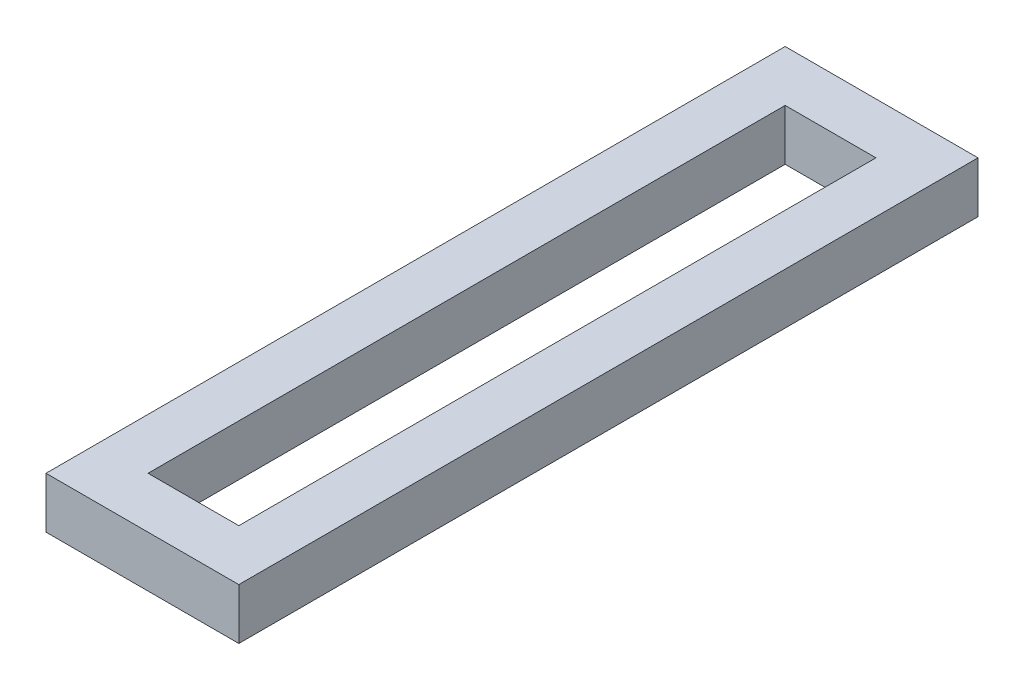
ISO-10303-21;
HEADER;
FILE_DESCRIPTION(('STEP AP214'),'2;1');
FILE_NAME('part.step','',(''),(''),'','','');
FILE_SCHEMA(('AUTOMOTIVE_DESIGN { 1 0 10303 214 1 1 1 1 }'));
ENDSEC;
DATA;
#1=APPLICATION_CONTEXT('core data for automotive mechanical design processes');
#2=APPLICATION_PROTOCOL_DEFINITION('international standard','automotive_design',2000,#1);
#3=PRODUCT_CONTEXT('',#1,'mechanical');
#4=PRODUCT('Part','Part','',(#3));
#5=PRODUCT_RELATED_PRODUCT_CATEGORY('part','',(#4));
#6=PRODUCT_DEFINITION_FORMATION('','',#4);
#7=PRODUCT_DEFINITION_CONTEXT('part definition',#1,'design');
#8=PRODUCT_DEFINITION('design','',#6,#7);
#9=PRODUCT_DEFINITION_SHAPE('','',#8);
#10=(LENGTH_UNIT() NAMED_UNIT(*) SI_UNIT(.MILLI.,.METRE.));
#11=(NAMED_UNIT(*) PLANE_ANGLE_UNIT() SI_UNIT($,.RADIAN.));
#12=(NAMED_UNIT(*) SI_UNIT($,.STERADIAN.) SOLID_ANGLE_UNIT());
#13=UNCERTAINTY_MEASURE_WITH_UNIT(LENGTH_MEASURE(1.E-05),#10,'distance_accuracy_value','');
#14=(GEOMETRIC_REPRESENTATION_CONTEXT(3) GLOBAL_UNCERTAINTY_ASSIGNED_CONTEXT((#13)) GLOBAL_UNIT_ASSIGNED_CONTEXT((#10,
#11,#12)) REPRESENTATION_CONTEXT('',''));
#15=CARTESIAN_POINT('',(0.,0.,0.));
#16=DIRECTION('',(0.,0.,1.));
#17=DIRECTION('',(1.,0.,0.));
#18=AXIS2_PLACEMENT_3D('',#15,#16,#17);
#19=CARTESIAN_POINT('',(0.,15.875,0.));
#20=DIRECTION('',(0.,1.,0.));
#21=DIRECTION('',(0.,0.,-1.));
#22=AXIS2_PLACEMENT_3D('',#19,#20,#21);
#23=PLANE('',#22);
#24=DIRECTION('',(0.,0.,-1.));
#25=VECTOR('',#24,1.);
#26=CARTESIAN_POINT('',(-30.,15.875,115.));
#27=LINE('',#26,#25);
#28=CARTESIAN_POINT('',(-30.,15.875,115.));
#29=VERTEX_POINT('',#28);
#30=CARTESIAN_POINT('',(-30.,15.875,-115.));
#31=VERTEX_POINT('',#30);
#32=EDGE_CURVE('E136',#29,#31,#27,.T.);
#33=ORIENTED_EDGE('',*,*,#32,.F.);
#34=DIRECTION('',(-1.,0.,0.));
#35=VECTOR('',#34,1.);
#36=CARTESIAN_POINT('',(-30.,15.875,115.));
#37=LINE('',#36,#35);
#38=CARTESIAN_POINT('',(30.,15.875,115.));
#39=VERTEX_POINT('',#38);
#40=EDGE_CURVE('E146',#39,#29,#37,.T.);
#41=ORIENTED_EDGE('',*,*,#40,.F.);
#42=DIRECTION('',(0.,0.,1.));
#43=VECTOR('',#42,1.);
#44=CARTESIAN_POINT('',(30.,15.875,115.));
#45=LINE('',#44,#43);
#46=CARTESIAN_POINT('',(30.,15.875,-115.));
#47=VERTEX_POINT('',#46);
#48=EDGE_CURVE('E143',#47,#39,#45,.T.);
#49=ORIENTED_EDGE('',*,*,#48,.F.);
#50=DIRECTION('',(1.,0.,0.));
#51=VECTOR('',#50,1.);
#52=CARTESIAN_POINT('',(-30.,15.875,-115.));
#53=LINE('',#52,#51);
#54=EDGE_CURVE('E139',#31,#47,#53,.T.);
#55=ORIENTED_EDGE('',*,*,#54,.F.);
#56=EDGE_LOOP('',(#33,#41,#49,#55));
#57=FACE_BOUND('',#56,.T.);
#58=DIRECTION('',(1.,0.,0.));
#59=VECTOR('',#58,1.);
#60=CARTESIAN_POINT('',(-14.125,15.875,-99.125));
#61=LINE('',#60,#59);
#62=CARTESIAN_POINT('',(-14.125,15.875,-99.125));
#63=VERTEX_POINT('',#62);
#64=CARTESIAN_POINT('',(14.125,15.875,-99.125));
#65=VERTEX_POINT('',#64);
#66=EDGE_CURVE('E117',#63,#65,#61,.T.);
#67=ORIENTED_EDGE('',*,*,#66,.T.);
#68=DIRECTION('',(0.,0.,1.));
#69=VECTOR('',#68,1.);
#70=CARTESIAN_POINT('',(14.125,15.875,99.125));
#71=LINE('',#70,#69);
#72=CARTESIAN_POINT('',(14.125,15.875,99.125));
#73=VERTEX_POINT('',#72);
#74=EDGE_CURVE('E122',#65,#73,#71,.T.);
#75=ORIENTED_EDGE('',*,*,#74,.T.);
#76=DIRECTION('',(-1.,0.,0.));
#77=VECTOR('',#76,1.);
#78=CARTESIAN_POINT('',(-14.125,15.875,99.125));
#79=LINE('',#78,#77);
#80=CARTESIAN_POINT('',(-14.125,15.875,99.125));
#81=VERTEX_POINT('',#80);
#82=EDGE_CURVE('E118',#73,#81,#79,.T.);
#83=ORIENTED_EDGE('',*,*,#82,.T.);
#84=DIRECTION('',(0.,0.,-1.));
#85=VECTOR('',#84,1.);
#86=CARTESIAN_POINT('',(-14.125,15.875,99.125));
#87=LINE('',#86,#85);
#88=EDGE_CURVE('E103',#81,#63,#87,.T.);
#89=ORIENTED_EDGE('',*,*,#88,.T.);
#90=EDGE_LOOP('',(#67,#75,#83,#89));
#91=FACE_BOUND('',#90,.T.);
#92=ADVANCED_FACE('F37',(#57,#91),#23,.T.);
#93=CARTESIAN_POINT('',(0.,0.,0.));
#94=DIRECTION('',(0.,1.,0.));
#95=DIRECTION('',(0.,0.,-1.));
#96=AXIS2_PLACEMENT_3D('',#93,#94,#95);
#97=PLANE('',#96);
#98=DIRECTION('',(0.,0.,-1.));
#99=VECTOR('',#98,1.);
#100=CARTESIAN_POINT('',(-30.,0.,115.));
#101=LINE('',#100,#99);
#102=CARTESIAN_POINT('',(-30.,0.,115.));
#103=VERTEX_POINT('',#102);
#104=CARTESIAN_POINT('',(-30.,0.,-115.));
#105=VERTEX_POINT('',#104);
#106=EDGE_CURVE('E111',#103,#105,#101,.T.);
#107=ORIENTED_EDGE('',*,*,#106,.T.);
#108=DIRECTION('',(1.,0.,0.));
#109=VECTOR('',#108,1.);
#110=CARTESIAN_POINT('',(-30.,0.,-115.));
#111=LINE('',#110,#109);
#112=CARTESIAN_POINT('',(30.,0.,-115.));
#113=VERTEX_POINT('',#112);
#114=EDGE_CURVE('E152',#105,#113,#111,.T.);
#115=ORIENTED_EDGE('',*,*,#114,.T.);
#116=DIRECTION('',(0.,0.,1.));
#117=VECTOR('',#116,1.);
#118=CARTESIAN_POINT('',(30.,0.,115.));
#119=LINE('',#118,#117);
#120=CARTESIAN_POINT('',(30.,0.,115.));
#121=VERTEX_POINT('',#120);
#122=EDGE_CURVE('E155',#113,#121,#119,.T.);
#123=ORIENTED_EDGE('',*,*,#122,.T.);
#124=DIRECTION('',(-1.,0.,0.));
#125=VECTOR('',#124,1.);
#126=CARTESIAN_POINT('',(-30.,0.,115.));
#127=LINE('',#126,#125);
#128=EDGE_CURVE('E140',#121,#103,#127,.T.);
#129=ORIENTED_EDGE('',*,*,#128,.T.);
#130=EDGE_LOOP('',(#107,#115,#123,#129));
#131=FACE_BOUND('',#130,.T.);
#132=DIRECTION('',(0.,0.,-1.));
#133=VECTOR('',#132,1.);
#134=CARTESIAN_POINT('',(-14.125,0.,99.125));
#135=LINE('',#134,#133);
#136=CARTESIAN_POINT('',(-14.125,0.,99.125));
#137=VERTEX_POINT('',#136);
#138=CARTESIAN_POINT('',(-14.125,0.,-99.125));
#139=VERTEX_POINT('',#138);
#140=EDGE_CURVE('E106',#137,#139,#135,.T.);
#141=ORIENTED_EDGE('',*,*,#140,.F.);
#142=DIRECTION('',(-1.,0.,0.));
#143=VECTOR('',#142,1.);
#144=CARTESIAN_POINT('',(-14.125,0.,99.125));
#145=LINE('',#144,#143);
#146=CARTESIAN_POINT('',(14.125,0.,99.125));
#147=VERTEX_POINT('',#146);
#148=EDGE_CURVE('E119',#147,#137,#145,.T.);
#149=ORIENTED_EDGE('',*,*,#148,.F.);
#150=DIRECTION('',(0.,0.,1.));
#151=VECTOR('',#150,1.);
#152=CARTESIAN_POINT('',(14.125,0.,99.125));
#153=LINE('',#152,#151);
#154=CARTESIAN_POINT('',(14.125,0.,-99.125));
#155=VERTEX_POINT('',#154);
#156=EDGE_CURVE('E130',#155,#147,#153,.T.);
#157=ORIENTED_EDGE('',*,*,#156,.F.);
#158=DIRECTION('',(1.,0.,0.));
#159=VECTOR('',#158,1.);
#160=CARTESIAN_POINT('',(-14.125,0.,-99.125));
#161=LINE('',#160,#159);
#162=EDGE_CURVE('E128',#139,#155,#161,.T.);
#163=ORIENTED_EDGE('',*,*,#162,.F.);
#164=EDGE_LOOP('',(#141,#149,#157,#163));
#165=FACE_BOUND('',#164,.T.);
#166=ADVANCED_FACE('F172',(#131,#165),#97,.F.);
#167=CARTESIAN_POINT('',(-30.,15.875,115.));
#168=DIRECTION('',(1.,0.,0.));
#169=DIRECTION('',(0.,0.,1.));
#170=AXIS2_PLACEMENT_3D('',#167,#168,#169);
#171=PLANE('',#170);
#172=ORIENTED_EDGE('',*,*,#106,.F.);
#173=DIRECTION('',(0.,-1.,0.));
#174=VECTOR('',#173,1.);
#175=CARTESIAN_POINT('',(-30.,15.875,115.));
#176=LINE('',#175,#174);
#177=EDGE_CURVE('E149',#29,#103,#176,.T.);
#178=ORIENTED_EDGE('',*,*,#177,.F.);
#179=ORIENTED_EDGE('',*,*,#32,.T.);
#180=DIRECTION('',(0.,-1.,0.));
#181=VECTOR('',#180,1.);
#182=CARTESIAN_POINT('',(-30.,15.875,-115.));
#183=LINE('',#182,#181);
#184=EDGE_CURVE('E11',#31,#105,#183,.T.);
#185=ORIENTED_EDGE('',*,*,#184,.T.);
#186=EDGE_LOOP('',(#172,#178,#179,#185));
#187=FACE_BOUND('',#186,.T.);
#188=ADVANCED_FACE('F39',(#187),#171,.F.);
#189=CARTESIAN_POINT('',(-30.,15.875,-115.));
#190=DIRECTION('',(0.,0.,1.));
#191=DIRECTION('',(-1.,0.,0.));
#192=AXIS2_PLACEMENT_3D('',#189,#190,#191);
#193=PLANE('',#192);
#194=ORIENTED_EDGE('',*,*,#114,.F.);
#195=ORIENTED_EDGE('',*,*,#184,.F.);
#196=ORIENTED_EDGE('',*,*,#54,.T.);
#197=DIRECTION('',(0.,-1.,0.));
#198=VECTOR('',#197,1.);
#199=CARTESIAN_POINT('',(30.,15.875,-115.));
#200=LINE('',#199,#198);
#201=EDGE_CURVE('E45',#47,#113,#200,.T.);
#202=ORIENTED_EDGE('',*,*,#201,.T.);
#203=EDGE_LOOP('',(#194,#195,#196,#202));
#204=FACE_BOUND('',#203,.T.);
#205=ADVANCED_FACE('F165',(#204),#193,.F.);
#206=CARTESIAN_POINT('',(30.,15.875,115.));
#207=DIRECTION('',(-1.,0.,0.));
#208=DIRECTION('',(0.,0.,-1.));
#209=AXIS2_PLACEMENT_3D('',#206,#207,#208);
#210=PLANE('',#209);
#211=ORIENTED_EDGE('',*,*,#122,.F.);
#212=ORIENTED_EDGE('',*,*,#201,.F.);
#213=ORIENTED_EDGE('',*,*,#48,.T.);
#214=DIRECTION('',(0.,-1.,0.));
#215=VECTOR('',#214,1.);
#216=CARTESIAN_POINT('',(30.,15.875,115.));
#217=LINE('',#216,#215);
#218=EDGE_CURVE('E161',#39,#121,#217,.T.);
#219=ORIENTED_EDGE('',*,*,#218,.T.);
#220=EDGE_LOOP('',(#211,#212,#213,#219));
#221=FACE_BOUND('',#220,.T.);
#222=ADVANCED_FACE('F169',(#221),#210,.F.);
#223=CARTESIAN_POINT('',(-30.,15.875,115.));
#224=DIRECTION('',(0.,0.,-1.));
#225=DIRECTION('',(1.,0.,0.));
#226=AXIS2_PLACEMENT_3D('',#223,#224,#225);
#227=PLANE('',#226);
#228=ORIENTED_EDGE('',*,*,#128,.F.);
#229=ORIENTED_EDGE('',*,*,#218,.F.);
#230=ORIENTED_EDGE('',*,*,#40,.T.);
#231=ORIENTED_EDGE('',*,*,#177,.T.);
#232=EDGE_LOOP('',(#228,#229,#230,#231));
#233=FACE_BOUND('',#232,.T.);
#234=ADVANCED_FACE('F180',(#233),#227,.F.);
#235=CARTESIAN_POINT('',(-14.125,15.875,99.125));
#236=DIRECTION('',(1.,0.,0.));
#237=DIRECTION('',(0.,0.,1.));
#238=AXIS2_PLACEMENT_3D('',#235,#236,#237);
#239=PLANE('',#238);
#240=ORIENTED_EDGE('',*,*,#140,.T.);
#241=DIRECTION('',(0.,-1.,0.));
#242=VECTOR('',#241,1.);
#243=CARTESIAN_POINT('',(-14.125,15.875,-99.125));
#244=LINE('',#243,#242);
#245=EDGE_CURVE('E100',#63,#139,#244,.T.);
#246=ORIENTED_EDGE('',*,*,#245,.F.);
#247=ORIENTED_EDGE('',*,*,#88,.F.);
#248=DIRECTION('',(0.,-1.,0.));
#249=VECTOR('',#248,1.);
#250=CARTESIAN_POINT('',(-14.125,15.875,99.125));
#251=LINE('',#250,#249);
#252=EDGE_CURVE('E60',#81,#137,#251,.T.);
#253=ORIENTED_EDGE('',*,*,#252,.T.);
#254=EDGE_LOOP('',(#240,#246,#247,#253));
#255=FACE_BOUND('',#254,.T.);
#256=ADVANCED_FACE('F102',(#255),#239,.T.);
#257=CARTESIAN_POINT('',(-14.125,15.875,-99.125));
#258=DIRECTION('',(0.,0.,1.));
#259=DIRECTION('',(-1.,0.,0.));
#260=AXIS2_PLACEMENT_3D('',#257,#258,#259);
#261=PLANE('',#260);
#262=ORIENTED_EDGE('',*,*,#162,.T.);
#263=DIRECTION('',(0.,-1.,0.));
#264=VECTOR('',#263,1.);
#265=CARTESIAN_POINT('',(14.125,15.875,-99.125));
#266=LINE('',#265,#264);
#267=EDGE_CURVE('E112',#65,#155,#266,.T.);
#268=ORIENTED_EDGE('',*,*,#267,.F.);
#269=ORIENTED_EDGE('',*,*,#66,.F.);
#270=ORIENTED_EDGE('',*,*,#245,.T.);
#271=EDGE_LOOP('',(#262,#268,#269,#270));
#272=FACE_BOUND('',#271,.T.);
#273=ADVANCED_FACE('F121',(#272),#261,.T.);
#274=CARTESIAN_POINT('',(14.125,15.875,99.125));
#275=DIRECTION('',(-1.,0.,0.));
#276=DIRECTION('',(0.,0.,-1.));
#277=AXIS2_PLACEMENT_3D('',#274,#275,#276);
#278=PLANE('',#277);
#279=ORIENTED_EDGE('',*,*,#156,.T.);
#280=DIRECTION('',(0.,-1.,0.));
#281=VECTOR('',#280,1.);
#282=CARTESIAN_POINT('',(14.125,15.875,99.125));
#283=LINE('',#282,#281);
#284=EDGE_CURVE('E52',#73,#147,#283,.T.);
#285=ORIENTED_EDGE('',*,*,#284,.F.);
#286=ORIENTED_EDGE('',*,*,#74,.F.);
#287=ORIENTED_EDGE('',*,*,#267,.T.);
#288=EDGE_LOOP('',(#279,#285,#286,#287));
#289=FACE_BOUND('',#288,.T.);
#290=ADVANCED_FACE('F198',(#289),#278,.T.);
#291=CARTESIAN_POINT('',(-14.125,15.875,99.125));
#292=DIRECTION('',(0.,0.,-1.));
#293=DIRECTION('',(1.,0.,0.));
#294=AXIS2_PLACEMENT_3D('',#291,#292,#293);
#295=PLANE('',#294);
#296=ORIENTED_EDGE('',*,*,#148,.T.);
#297=ORIENTED_EDGE('',*,*,#252,.F.);
#298=ORIENTED_EDGE('',*,*,#82,.F.);
#299=ORIENTED_EDGE('',*,*,#284,.T.);
#300=EDGE_LOOP('',(#296,#297,#298,#299));
#301=FACE_BOUND('',#300,.T.);
#302=ADVANCED_FACE('F201',(#301),#295,.T.);
#303=CLOSED_SHELL('',(#92,#166,#188,#205,#222,#234,#256,#273,#290,#302));
#304=MANIFOLD_SOLID_BREP('B2',#303);
#305=ADVANCED_BREP_SHAPE_REPRESENTATION('',(#18,#304),#14);
#306=SHAPE_DEFINITION_REPRESENTATION(#9,#305);
ENDSEC;
END-ISO-10303-21;
